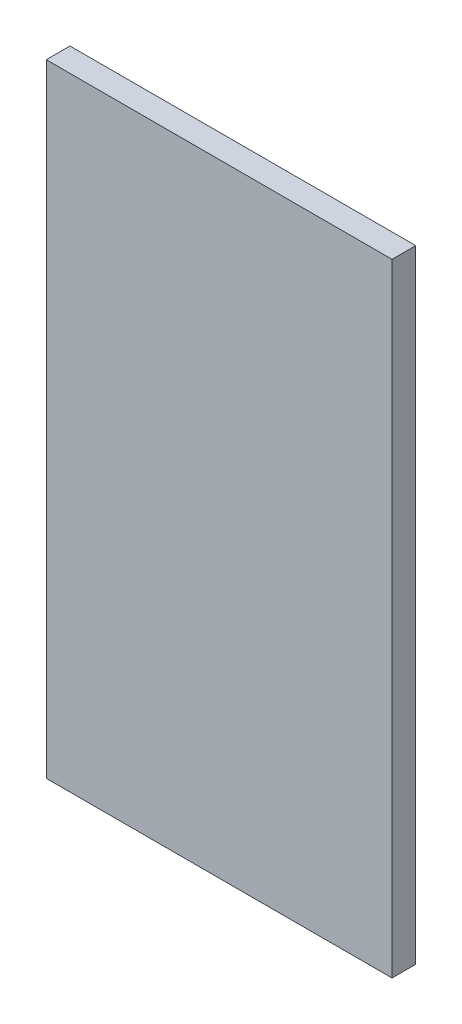
ISO-10303-21;
HEADER;
FILE_DESCRIPTION(('STEP AP214'),'2;1');
FILE_NAME('part.step','',(''),(''),'','','');
FILE_SCHEMA(('AUTOMOTIVE_DESIGN { 1 0 10303 214 1 1 1 1 }'));
ENDSEC;
DATA;
#1=APPLICATION_CONTEXT('core data for automotive mechanical design processes');
#2=APPLICATION_PROTOCOL_DEFINITION('international standard','automotive_design',2000,#1);
#3=PRODUCT_CONTEXT('',#1,'mechanical');
#4=PRODUCT('Part','Part','',(#3));
#5=PRODUCT_RELATED_PRODUCT_CATEGORY('part','',(#4));
#6=PRODUCT_DEFINITION_FORMATION('','',#4);
#7=PRODUCT_DEFINITION_CONTEXT('part definition',#1,'design');
#8=PRODUCT_DEFINITION('design','',#6,#7);
#9=PRODUCT_DEFINITION_SHAPE('','',#8);
#10=(LENGTH_UNIT() NAMED_UNIT(*) SI_UNIT(.MILLI.,.METRE.));
#11=(NAMED_UNIT(*) PLANE_ANGLE_UNIT() SI_UNIT($,.RADIAN.));
#12=(NAMED_UNIT(*) SI_UNIT($,.STERADIAN.) SOLID_ANGLE_UNIT());
#13=UNCERTAINTY_MEASURE_WITH_UNIT(LENGTH_MEASURE(1.E-05),#10,'distance_accuracy_value','');
#14=(GEOMETRIC_REPRESENTATION_CONTEXT(3) GLOBAL_UNCERTAINTY_ASSIGNED_CONTEXT((#13)) GLOBAL_UNIT_ASSIGNED_CONTEXT((#10,
#11,#12)) REPRESENTATION_CONTEXT('',''));
#15=CARTESIAN_POINT('',(0.,0.,0.));
#16=DIRECTION('',(0.,0.,1.));
#17=DIRECTION('',(1.,0.,0.));
#18=AXIS2_PLACEMENT_3D('',#15,#16,#17);
#19=CARTESIAN_POINT('',(5.80008,10.5,0.));
#20=DIRECTION('',(0.,0.,-1.));
#21=DIRECTION('',(-1.,0.,0.));
#22=AXIS2_PLACEMENT_3D('',#19,#20,#21);
#23=PLANE('',#22);
#24=DIRECTION('',(1.,0.,0.));
#25=VECTOR('',#24,1.);
#26=CARTESIAN_POINT('',(5.55008,10.95,0.));
#27=LINE('',#26,#25);
#28=CARTESIAN_POINT('',(5.55008,10.95,0.));
#29=VERTEX_POINT('',#28);
#30=CARTESIAN_POINT('',(6.05008,10.95,0.));
#31=VERTEX_POINT('',#30);
#32=EDGE_CURVE('E55',#29,#31,#27,.T.);
#33=ORIENTED_EDGE('',*,*,#32,.T.);
#34=DIRECTION('',(0.,1.,0.));
#35=VECTOR('',#34,1.);
#36=CARTESIAN_POINT('',(6.05008,10.95,0.));
#37=LINE('',#36,#35);
#38=CARTESIAN_POINT('',(6.05008,10.05,0.));
#39=VERTEX_POINT('',#38);
#40=EDGE_CURVE('E57',#31,#39,#37,.F.);
#41=ORIENTED_EDGE('',*,*,#40,.T.);
#42=DIRECTION('',(1.,0.,0.));
#43=VECTOR('',#42,1.);
#44=CARTESIAN_POINT('',(6.05008,10.05,0.));
#45=LINE('',#44,#43);
#46=CARTESIAN_POINT('',(5.55008,10.05,0.));
#47=VERTEX_POINT('',#46);
#48=EDGE_CURVE('E20',#39,#47,#45,.F.);
#49=ORIENTED_EDGE('',*,*,#48,.T.);
#50=DIRECTION('',(0.,1.,0.));
#51=VECTOR('',#50,1.);
#52=CARTESIAN_POINT('',(5.55008,10.05,0.));
#53=LINE('',#52,#51);
#54=EDGE_CURVE('E80',#47,#29,#53,.T.);
#55=ORIENTED_EDGE('',*,*,#54,.T.);
#56=EDGE_LOOP('',(#33,#41,#49,#55));
#57=FACE_BOUND('',#56,.T.);
#58=ADVANCED_FACE('F17',(#57),#23,.T.);
#59=CARTESIAN_POINT('',(6.05008,10.05,0.));
#60=DIRECTION('',(0.,1.,0.));
#61=DIRECTION('',(0.,0.,1.));
#62=AXIS2_PLACEMENT_3D('',#59,#60,#61);
#63=PLANE('',#62);
#64=DIRECTION('',(0.,0.,-1.));
#65=VECTOR('',#64,1.);
#66=CARTESIAN_POINT('',(5.55008,10.05,0.));
#67=LINE('',#66,#65);
#68=CARTESIAN_POINT('',(5.55008,10.05,0.03429));
#69=VERTEX_POINT('',#68);
#70=EDGE_CURVE('E68',#69,#47,#67,.T.);
#71=ORIENTED_EDGE('',*,*,#70,.T.);
#72=ORIENTED_EDGE('',*,*,#48,.F.);
#73=DIRECTION('',(0.,0.,1.));
#74=VECTOR('',#73,1.);
#75=CARTESIAN_POINT('',(6.05008,10.05,0.));
#76=LINE('',#75,#74);
#77=CARTESIAN_POINT('',(6.05008,10.05,0.03429));
#78=VERTEX_POINT('',#77);
#79=EDGE_CURVE('E63',#39,#78,#76,.T.);
#80=ORIENTED_EDGE('',*,*,#79,.T.);
#81=DIRECTION('',(1.,0.,0.));
#82=VECTOR('',#81,1.);
#83=CARTESIAN_POINT('',(5.80008,10.05,0.03429));
#84=LINE('',#83,#82);
#85=EDGE_CURVE('E83',#69,#78,#84,.T.);
#86=ORIENTED_EDGE('',*,*,#85,.F.);
#87=EDGE_LOOP('',(#71,#72,#80,#86));
#88=FACE_BOUND('',#87,.T.);
#89=ADVANCED_FACE('F65',(#88),#63,.F.);
#90=CARTESIAN_POINT('',(6.05008,10.95,0.));
#91=DIRECTION('',(-1.,0.,0.));
#92=DIRECTION('',(0.,0.,1.));
#93=AXIS2_PLACEMENT_3D('',#90,#91,#92);
#94=PLANE('',#93);
#95=ORIENTED_EDGE('',*,*,#79,.F.);
#96=ORIENTED_EDGE('',*,*,#40,.F.);
#97=DIRECTION('',(0.,0.,-1.));
#98=VECTOR('',#97,1.);
#99=CARTESIAN_POINT('',(6.05008,10.95,0.));
#100=LINE('',#99,#98);
#101=CARTESIAN_POINT('',(6.05008,10.95,0.03429));
#102=VERTEX_POINT('',#101);
#103=EDGE_CURVE('E75',#31,#102,#100,.F.);
#104=ORIENTED_EDGE('',*,*,#103,.T.);
#105=DIRECTION('',(0.,1.,0.));
#106=VECTOR('',#105,1.);
#107=CARTESIAN_POINT('',(6.05008,10.5,0.03429));
#108=LINE('',#107,#106);
#109=EDGE_CURVE('E72',#78,#102,#108,.T.);
#110=ORIENTED_EDGE('',*,*,#109,.F.);
#111=EDGE_LOOP('',(#95,#96,#104,#110));
#112=FACE_BOUND('',#111,.T.);
#113=ADVANCED_FACE('F70',(#112),#94,.F.);
#114=CARTESIAN_POINT('',(5.55008,10.95,0.));
#115=DIRECTION('',(0.,-1.,0.));
#116=DIRECTION('',(0.,0.,-1.));
#117=AXIS2_PLACEMENT_3D('',#114,#115,#116);
#118=PLANE('',#117);
#119=ORIENTED_EDGE('',*,*,#103,.F.);
#120=ORIENTED_EDGE('',*,*,#32,.F.);
#121=DIRECTION('',(0.,0.,-1.));
#122=VECTOR('',#121,1.);
#123=CARTESIAN_POINT('',(5.55008,10.95,0.));
#124=LINE('',#123,#122);
#125=CARTESIAN_POINT('',(5.55008,10.95,0.03429));
#126=VERTEX_POINT('',#125);
#127=EDGE_CURVE('E35',#29,#126,#124,.F.);
#128=ORIENTED_EDGE('',*,*,#127,.T.);
#129=DIRECTION('',(1.,0.,0.));
#130=VECTOR('',#129,1.);
#131=CARTESIAN_POINT('',(5.80008,10.95,0.03429));
#132=LINE('',#131,#130);
#133=EDGE_CURVE('E26',#102,#126,#132,.F.);
#134=ORIENTED_EDGE('',*,*,#133,.F.);
#135=EDGE_LOOP('',(#119,#120,#128,#134));
#136=FACE_BOUND('',#135,.T.);
#137=ADVANCED_FACE('F89',(#136),#118,.F.);
#138=CARTESIAN_POINT('',(5.55008,10.05,0.));
#139=DIRECTION('',(1.,0.,0.));
#140=DIRECTION('',(0.,0.,-1.));
#141=AXIS2_PLACEMENT_3D('',#138,#139,#140);
#142=PLANE('',#141);
#143=ORIENTED_EDGE('',*,*,#127,.F.);
#144=ORIENTED_EDGE('',*,*,#54,.F.);
#145=ORIENTED_EDGE('',*,*,#70,.F.);
#146=DIRECTION('',(0.,1.,0.));
#147=VECTOR('',#146,1.);
#148=CARTESIAN_POINT('',(5.55008,10.5,0.03429));
#149=LINE('',#148,#147);
#150=EDGE_CURVE('E11',#126,#69,#149,.F.);
#151=ORIENTED_EDGE('',*,*,#150,.F.);
#152=EDGE_LOOP('',(#143,#144,#145,#151));
#153=FACE_BOUND('',#152,.T.);
#154=ADVANCED_FACE('F91',(#153),#142,.F.);
#155=CARTESIAN_POINT('',(5.80008,10.5,0.03429));
#156=DIRECTION('',(0.,0.,1.));
#157=DIRECTION('',(1.,0.,0.));
#158=AXIS2_PLACEMENT_3D('',#155,#156,#157);
#159=PLANE('',#158);
#160=ORIENTED_EDGE('',*,*,#133,.T.);
#161=ORIENTED_EDGE('',*,*,#150,.T.);
#162=ORIENTED_EDGE('',*,*,#85,.T.);
#163=ORIENTED_EDGE('',*,*,#109,.T.);
#164=EDGE_LOOP('',(#160,#161,#162,#163));
#165=FACE_BOUND('',#164,.T.);
#166=ADVANCED_FACE('F88',(#165),#159,.T.);
#167=CLOSED_SHELL('',(#58,#89,#113,#137,#154,#166));
#168=MANIFOLD_SOLID_BREP('B1',#167);
#169=ADVANCED_BREP_SHAPE_REPRESENTATION('',(#18,#168),#14);
#170=SHAPE_DEFINITION_REPRESENTATION(#9,#169);
ENDSEC;
END-ISO-10303-21;
